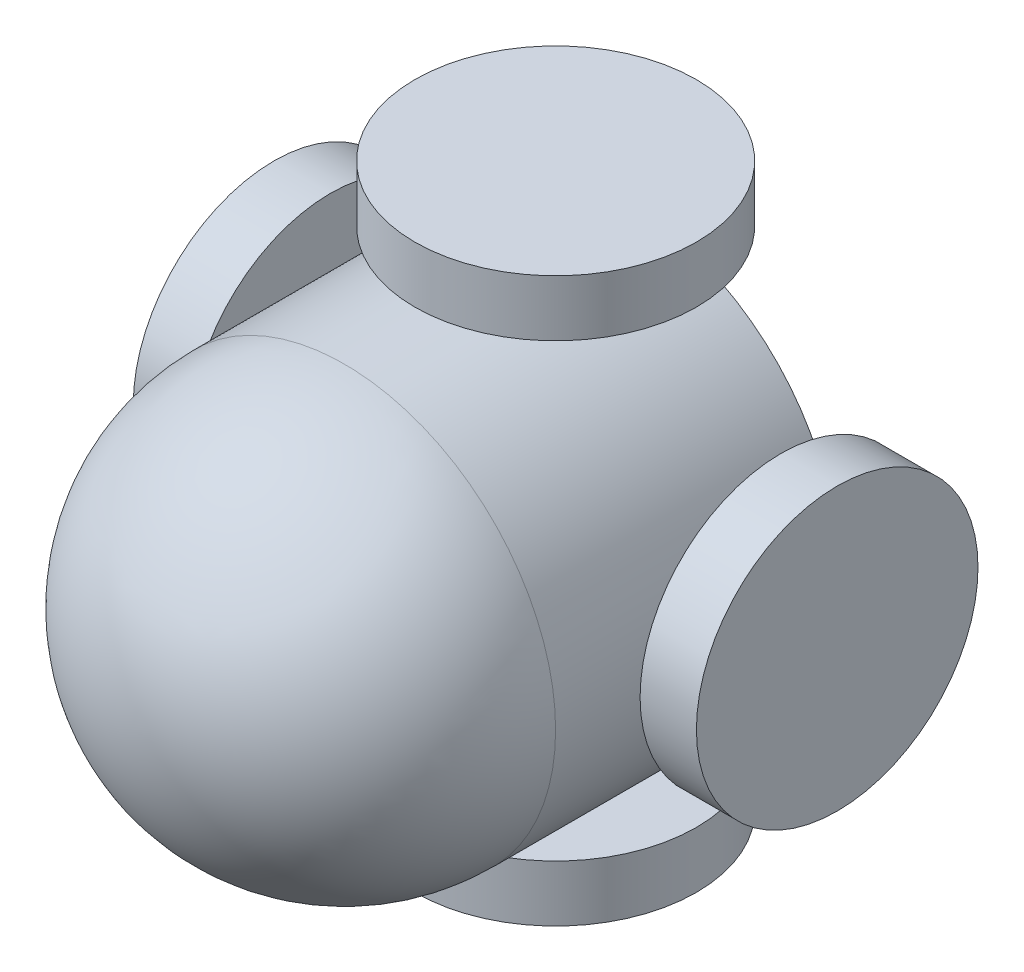
ISO-10303-21;
HEADER;
FILE_DESCRIPTION(('STEP AP214'),'2;1');
FILE_NAME('part.step','',(''),(''),'','','');
FILE_SCHEMA(('AUTOMOTIVE_DESIGN { 1 0 10303 214 1 1 1 1 }'));
ENDSEC;
DATA;
#1=APPLICATION_CONTEXT('core data for automotive mechanical design processes');
#2=APPLICATION_PROTOCOL_DEFINITION('international standard','automotive_design',2000,#1);
#3=PRODUCT_CONTEXT('',#1,'mechanical');
#4=PRODUCT('Part','Part','',(#3));
#5=PRODUCT_RELATED_PRODUCT_CATEGORY('part','',(#4));
#6=PRODUCT_DEFINITION_FORMATION('','',#4);
#7=PRODUCT_DEFINITION_CONTEXT('part definition',#1,'design');
#8=PRODUCT_DEFINITION('design','',#6,#7);
#9=PRODUCT_DEFINITION_SHAPE('','',#8);
#10=(LENGTH_UNIT() NAMED_UNIT(*) SI_UNIT(.MILLI.,.METRE.));
#11=(NAMED_UNIT(*) PLANE_ANGLE_UNIT() SI_UNIT($,.RADIAN.));
#12=(NAMED_UNIT(*) SI_UNIT($,.STERADIAN.) SOLID_ANGLE_UNIT());
#13=UNCERTAINTY_MEASURE_WITH_UNIT(LENGTH_MEASURE(1.E-05),#10,'distance_accuracy_value','');
#14=(GEOMETRIC_REPRESENTATION_CONTEXT(3) GLOBAL_UNCERTAINTY_ASSIGNED_CONTEXT((#13)) GLOBAL_UNIT_ASSIGNED_CONTEXT((#10,
#11,#12)) REPRESENTATION_CONTEXT('',''));
#15=CARTESIAN_POINT('',(0.,0.,0.));
#16=DIRECTION('',(0.,0.,1.));
#17=DIRECTION('',(1.,0.,0.));
#18=AXIS2_PLACEMENT_3D('',#15,#16,#17);
#19=CARTESIAN_POINT('',(0.,2.,1.));
#20=DIRECTION('',(0.,-1.,0.));
#21=DIRECTION('',(1.,0.,0.));
#22=AXIS2_PLACEMENT_3D('',#19,#20,#21);
#23=CYLINDRICAL_SURFACE('',#22,0.25);
#24=CARTESIAN_POINT('',(0.250000000000005,-1.4790199457749,1.));
#25=CARTESIAN_POINT('',(0.249999439842106,-1.47902019740128,1.0139375748146));
#26=CARTESIAN_POINT('',(0.248830516903737,-1.47921909254807,1.02788276060249));
#27=CARTESIAN_POINT('',(0.244187742807545,-1.47999245736818,1.05538185432202));
#28=CARTESIAN_POINT('',(0.240711766030971,-1.48056727339143,1.06893538937495));
#29=CARTESIAN_POINT('',(0.231562954366719,-1.48202560932232,1.09524922833568));
#30=CARTESIAN_POINT('',(0.225891955493114,-1.48290887117195,1.10801018486663));
#31=CARTESIAN_POINT('',(0.212518649689042,-1.48488427211434,1.13239809547137));
#32=CARTESIAN_POINT('',(0.204816571350162,-1.48597638769747,1.14402517695762));
#33=CARTESIAN_POINT('',(0.187518752696635,-1.48825847115261,1.16593128497457));
#34=CARTESIAN_POINT('',(0.177906904893233,-1.48944921732707,1.17619751313865));
#35=CARTESIAN_POINT('',(0.157097200469539,-1.49178748066946,1.19497933068615));
#36=CARTESIAN_POINT('',(0.145899249915004,-1.49293499527197,1.20349481631153));
#37=CARTESIAN_POINT('',(0.122152286994839,-1.49506573698247,1.21858145672194));
#38=CARTESIAN_POINT('',(0.109595608145676,-1.49604794243228,1.22514070077318));
#39=CARTESIAN_POINT('',(0.0835395621723927,-1.49772873695715,1.23605210705305));
#40=CARTESIAN_POINT('',(0.0700402564078244,-1.49842734447267,1.24040441278849));
#41=CARTESIAN_POINT('',(0.0426143726344296,-1.49945673472438,1.24673925349839));
#42=CARTESIAN_POINT('',(0.0286928886679326,-1.4997908531109,1.24874329160047));
#43=CARTESIAN_POINT('',(0.000707528552585234,-1.50006507934278,1.25039157541526));
#44=CARTESIAN_POINT('',(-0.0133563378528844,-1.50000521396931,1.25003598152472));
#45=CARTESIAN_POINT('',(-0.0410802185078822,-1.49950085843139,1.24699186484718));
#46=CARTESIAN_POINT('',(-0.0547428530700087,-1.4990601836924,1.24432648365909));
#47=CARTESIAN_POINT('',(-0.0814241979611737,-1.49784797877164,1.23677489257535));
#48=CARTESIAN_POINT('',(-0.094442888665145,-1.49707643851321,1.23188861504105));
#49=CARTESIAN_POINT('',(-0.119535614778259,-1.49528269851196,1.22001093596847));
#50=CARTESIAN_POINT('',(-0.131605052301899,-1.49425936732688,1.21300999879176));
#51=CARTESIAN_POINT('',(-0.154406552984659,-1.4920757380715,1.1971087177365));
#52=CARTESIAN_POINT('',(-0.165138507791582,-1.49091542891914,1.18820822012892));
#53=CARTESIAN_POINT('',(-0.185097127344661,-1.4885702682326,1.16863211933807));
#54=CARTESIAN_POINT('',(-0.194303950225315,-1.48738528973104,1.1579362905099));
#55=CARTESIAN_POINT('',(-0.210795458844801,-1.48513795978481,1.13514129097842));
#56=CARTESIAN_POINT('',(-0.218080126853236,-1.48407560947133,1.12304210733172));
#57=CARTESIAN_POINT('',(-0.230524443448823,-1.48219375456182,1.09776083581225));
#58=CARTESIAN_POINT('',(-0.235681702727919,-1.4813745233026,1.08457755019079));
#59=CARTESIAN_POINT('',(-0.243702987081557,-1.48007618868988,1.05751509276925));
#60=CARTESIAN_POINT('',(-0.24656721407679,-1.47959705538832,1.04363598235676));
#61=CARTESIAN_POINT('',(-0.249893188487921,-1.47903895942212,1.01575338438379));
#62=CARTESIAN_POINT('',(-0.250383220791239,-1.47895528575867,1.00175336202979));
#63=CARTESIAN_POINT('',(-0.249022270268241,-1.47918503478236,0.973871332830918));
#64=CARTESIAN_POINT('',(-0.247171377862461,-1.47949844213185,0.959989321448603));
#65=CARTESIAN_POINT('',(-0.241205233492805,-1.48048268745502,0.932827224080914));
#66=CARTESIAN_POINT('',(-0.237104379064633,-1.48115125191835,0.919543886012199));
#67=CARTESIAN_POINT('',(-0.226769819019222,-1.4827685730055,0.893852983372052));
#68=CARTESIAN_POINT('',(-0.220535985810088,-1.48371734639058,0.88144547124491));
#69=CARTESIAN_POINT('',(-0.206045667322918,-1.48579912839739,0.857732540559389));
#70=CARTESIAN_POINT('',(-0.197771056415931,-1.48693375560035,0.846438342724394));
#71=CARTESIAN_POINT('',(-0.179458946570793,-1.48925466667987,0.8253886467305));
#72=CARTESIAN_POINT('',(-0.169421323638399,-1.49044095418533,0.815633256889026));
#73=CARTESIAN_POINT('',(-0.147742807032876,-1.49274642211826,0.79783481072713));
#74=CARTESIAN_POINT('',(-0.136086325338614,-1.49386477634467,0.789810617371546));
#75=CARTESIAN_POINT('',(-0.111574344794927,-1.49589511243294,0.775834467299512));
#76=CARTESIAN_POINT('',(-0.0987188847470574,-1.49680710096998,0.769882443552615));
#77=CARTESIAN_POINT('',(-0.0722299051501275,-1.49831835816958,0.760248941604514));
#78=CARTESIAN_POINT('',(-0.0586000562602558,-1.49891898456762,0.756557592426508));
#79=CARTESIAN_POINT('',(-0.030903073487416,-1.49974558316928,0.751518440103617));
#80=CARTESIAN_POINT('',(-0.0168359756821572,-1.49997158620018,0.750170444126764));
#81=CARTESIAN_POINT('',(0.0111541275773733,-1.50002303788783,0.749861811768781));
#82=CARTESIAN_POINT('',(0.0250768160602731,-1.49985330202424,0.750872474605894));
#83=CARTESIAN_POINT('',(0.0525511974314742,-1.49914217838728,0.75519039222694));
#84=CARTESIAN_POINT('',(0.0661028923967477,-1.498600792695,0.758497634150956));
#85=CARTESIAN_POINT('',(0.0924396445918645,-1.49720698882758,0.767303816554376));
#86=CARTESIAN_POINT('',(0.105225537215408,-1.49635491704155,0.772800316821045));
#87=CARTESIAN_POINT('',(0.129698045298202,-1.49443275687735,0.785825793623018));
#88=CARTESIAN_POINT('',(0.141384608611752,-1.49336265816488,0.793354866506097));
#89=CARTESIAN_POINT('',(0.163471294552721,-1.49110762961897,0.8103335092462));
#90=CARTESIAN_POINT('',(0.173855143060567,-1.48992152455073,0.819804095475687));
#91=CARTESIAN_POINT('',(0.19289638759481,-1.48757630330475,0.840352830789819));
#92=CARTESIAN_POINT('',(0.201553378670124,-1.4864171935136,0.851431355889154));
#93=CARTESIAN_POINT('',(0.216951427091967,-1.4842483435701,0.874974532250764));
#94=CARTESIAN_POINT('',(0.223678498909459,-1.48323971798123,0.887448433983805));
#95=CARTESIAN_POINT('',(0.234931453644096,-1.48149921022177,0.913360923591143));
#96=CARTESIAN_POINT('',(0.239459535523165,-1.48076705175127,0.926798532269689));
#97=CARTESIAN_POINT('',(0.24520260531222,-1.47982474483778,0.950240376947666));
#98=CARTESIAN_POINT('',(0.246998741767033,-1.47952462342102,0.960102680795843));
#99=CARTESIAN_POINT('',(0.249397629518247,-1.47912213528652,0.979975348484111));
#100=CARTESIAN_POINT('',(0.250000402479198,-1.47901976497878,0.989985709633016));
#101=CARTESIAN_POINT('',(0.250000000000005,-1.4790199457749,1.));
#102=B_SPLINE_CURVE_WITH_KNOTS('',3,(#24,#25,#26,#27,#28,#29,#30,#31,#32,#33,#34,#35,#36,#37,
#38,#39,#40,#41,#42,#43,#44,#45,#46,#47,#48,#49,#50,#51,#52,#53,#54,#55,#56,#57,#58,#59,#60,#61,
#62,#63,#64,#65,#66,#67,#68,#69,#70,#71,#72,#73,#74,#75,#76,#77,#78,#79,#80,#81,#82,#83,#84,#85,
#86,#87,#88,#89,#90,#91,#92,#93,#94,#95,#96,#97,#98,#99,#100,#101),.UNSPECIFIED.,.T.,.F.,(4,2,2,
2,2,2,2,2,2,2,2,2,2,2,2,2,2,2,2,2,2,2,2,2,2,2,2,2,2,2,2,2,2,2,2,2,2,2,4),(0.,0.0417761038905316,
0.0835907519919449,0.125370499783167,0.167145547400922,0.209289159151362,0.251435267830095,
0.293832980107083,0.336227935106761,0.378231567468213,0.42023234464834,0.461817121160316,
0.503403164245181,0.545179604135073,0.586959426222412,0.629246123457771,0.671533210741667,
0.713867662494251,0.756198385933725,0.798023542416058,0.839847083409624,0.88140606463114,
0.922967532289222,0.96491234275835,1.00686010442634,1.04924411303103,1.09162675047235,
1.13382298441329,1.176015745908,1.21769777626156,1.25937957321447,1.30101503982811,
1.34265248038798,1.3847669974589,1.42689137887746,1.46931372761285,1.51169356673763,
1.54171067053694,1.57172722939499),.UNSPECIFIED.);
#103=CARTESIAN_POINT('',(0.250000000000005,-1.4790199457749,1.));
#104=VERTEX_POINT('',#103);
#105=EDGE_CURVE('E82',#104,#104,#102,.T.);
#106=ORIENTED_EDGE('',*,*,#105,.T.);
#107=EDGE_LOOP('',(#106));
#108=FACE_BOUND('',#107,.T.);
#109=CARTESIAN_POINT('',(0.,-1.6,1.));
#110=DIRECTION('',(0.,-1.,0.));
#111=DIRECTION('',(1.,0.,0.));
#112=AXIS2_PLACEMENT_3D('',#109,#110,#111);
#113=CIRCLE('',#112,0.25);
#114=CARTESIAN_POINT('',(0.250000000000006,-1.6,1.));
#115=VERTEX_POINT('',#114);
#116=EDGE_CURVE('E10',#115,#115,#113,.T.);
#117=ORIENTED_EDGE('',*,*,#116,.F.);
#118=EDGE_LOOP('',(#117));
#119=FACE_BOUND('',#118,.T.);
#120=ADVANCED_FACE('F30',(#108,#119),#23,.T.);
#121=CARTESIAN_POINT('',(-2.,0.,1.));
#122=DIRECTION('',(1.,0.,0.));
#123=DIRECTION('',(0.,0.,-1.));
#124=AXIS2_PLACEMENT_3D('',#121,#122,#123);
#125=CYLINDRICAL_SURFACE('',#124,0.25);
#126=CARTESIAN_POINT('',(-1.5,0.,1.25));
#127=CARTESIAN_POINT('',(-1.49999976116882,0.0139390904958215,1.24999944110522));
#128=CARTESIAN_POINT('',(-1.49980367791303,0.0278857881838821,1.24883027250311));
#129=CARTESIAN_POINT('',(-1.49904034494139,0.0553880221673043,1.24418643412347));
#130=CARTESIAN_POINT('',(-1.49847275392389,0.0689431867959247,1.24070964430884));
#131=CARTESIAN_POINT('',(-1.49703006823645,0.0952604747212644,1.23155845514072));
#132=CARTESIAN_POINT('',(-1.49615522515919,0.10802323684319,1.22588585343594));
#133=CARTESIAN_POINT('',(-1.49419422708207,0.132414184197795,1.21250877079476));
#134=CARTESIAN_POINT('',(-1.49310809625443,0.144042498987859,1.2048045222517));
#135=CARTESIAN_POINT('',(-1.49083331745831,0.165947261429168,1.18750449161795));
#136=CARTESIAN_POINT('',(-1.48964387181486,0.176211290353497,1.17789308853639));
#137=CARTESIAN_POINT('',(-1.48730262687673,0.194988849865993,1.15708520315272));
#138=CARTESIAN_POINT('',(-1.48615082996267,0.203502269939097,1.14588862085434));
#139=CARTESIAN_POINT('',(-1.48400756575978,0.218586712560513,1.12214290338029));
#140=CARTESIAN_POINT('',(-1.48301712909164,0.2251454552861,1.10958586631952));
#141=CARTESIAN_POINT('',(-1.48131978979468,0.236055836541122,1.08352904356994));
#142=CARTESIAN_POINT('',(-1.48061286801431,0.240407624156561,1.07002932163224));
#143=CARTESIAN_POINT('',(-1.47957053684276,0.246741437778481,1.04260197251435));
#144=CARTESIAN_POINT('',(-1.4792317684857,0.24874490291354,1.02867942634986));
#145=CARTESIAN_POINT('',(-1.47895393893665,0.250391672528988,1.00069197231165));
#146=CARTESIAN_POINT('',(-1.47901484945721,0.2500351440389,0.98662707458327));
#147=CARTESIAN_POINT('',(-1.47952642886356,0.246989509839615,0.958907213872455));
#148=CARTESIAN_POINT('',(-1.47997307331892,0.244324488188978,0.945249519645477));
#149=CARTESIAN_POINT('',(-1.48119949521101,0.236775314040345,0.918577868217087));
#150=CARTESIAN_POINT('',(-1.48197928407327,0.231891085431974,0.905563933111145));
#151=CARTESIAN_POINT('',(-1.4837884793341,0.220017724609391,0.880477117655908));
#152=CARTESIAN_POINT('',(-1.48481906710733,0.213018591387972,0.868409059391877));
#153=CARTESIAN_POINT('',(-1.48701291841501,0.197121201755744,0.845609559946162));
#154=CARTESIAN_POINT('',(-1.48817619265429,0.188222792065429,0.834878226754507));
#155=CARTESIAN_POINT('',(-1.49052202787979,0.168648221215906,0.814917391419265));
#156=CARTESIAN_POINT('',(-1.49170464923165,0.157951396387313,0.805708148145992));
#157=CARTESIAN_POINT('',(-1.49394260139672,0.135153524898165,0.789212223733466));
#158=CARTESIAN_POINT('',(-1.49499793138975,0.123052469190642,0.781925554981677));
#159=CARTESIAN_POINT('',(-1.49686389289291,0.0977705916166714,0.769479777286372));
#160=CARTESIAN_POINT('',(-1.49767431840745,0.0845888725564664,0.764322458066874));
#161=CARTESIAN_POINT('',(-1.49895750301266,0.0575298345602734,0.756300578475402));
#162=CARTESIAN_POINT('',(-1.49943029035047,0.0436525739179471,0.753435826302628));
#163=CARTESIAN_POINT('',(-1.49998112984269,0.0157709901301626,0.750107864153887));
#164=CARTESIAN_POINT('',(-1.50006375301278,0.00177007371510134,0.749616842819439));
#165=CARTESIAN_POINT('',(-1.49983747442117,-0.0261139772889885,0.750976134442812));
#166=CARTESIAN_POINT('',(-1.49952858772412,-0.0399971163892036,0.752826357313374));
#167=CARTESIAN_POINT('',(-1.4985568269382,-0.0671656175546761,0.758792484933548));
#168=CARTESIAN_POINT('',(-1.49789610480131,-0.0804540868385377,0.762894620839012));
#169=CARTESIAN_POINT('',(-1.49629446445536,-0.106154688486044,0.773233451819953));
#170=CARTESIAN_POINT('',(-1.49535353051202,-0.118566771590972,0.779470266763527));
#171=CARTESIAN_POINT('',(-1.49328451630241,-0.142283068946896,0.793965112469679));
#172=CARTESIAN_POINT('',(-1.49215485588702,-0.153576525093715,0.802240515616725));
#173=CARTESIAN_POINT('',(-1.4898384673919,-0.174624358550269,0.820553731538506));
#174=CARTESIAN_POINT('',(-1.48865173517155,-0.184378623969658,0.830591672327667));
#175=CARTESIAN_POINT('',(-1.48634017523585,-0.2021742779658,0.852269754807142));
#176=CARTESIAN_POINT('',(-1.48521611613711,-0.210196876111371,0.863925416551441));
#177=CARTESIAN_POINT('',(-1.48317152977788,-0.224170231029498,0.888435296913854));
#178=CARTESIAN_POINT('',(-1.48225099606602,-0.230121053476982,0.901289477522749));
#179=CARTESIAN_POINT('',(-1.4807234536977,-0.239753833147315,0.927778973281213));
#180=CARTESIAN_POINT('',(-1.48011515431106,-0.243445143254794,0.941410809503049));
#181=CARTESIAN_POINT('',(-1.47927771683526,-0.248483545377828,0.969112012922176));
#182=CARTESIAN_POINT('',(-1.47904854578272,-0.249830841194617,0.983181341973205));
#183=CARTESIAN_POINT('',(-1.47899673308401,-0.250137286604735,1.01117051659624));
#184=CARTESIAN_POINT('',(-1.47916905650565,-0.249126013612519,1.02509003785753));
#185=CARTESIAN_POINT('',(-1.47988978145373,-0.244807983895685,1.05255792480508));
#186=CARTESIAN_POINT('',(-1.48043818176121,-0.241501234611248,1.06610629169419));
#187=CARTESIAN_POINT('',(-1.48184735628172,-0.23269744895949,1.09243584372926));
#188=CARTESIAN_POINT('',(-1.48270776721967,-0.227202959060044,1.1052179010056));
#189=CARTESIAN_POINT('',(-1.48464436892221,-0.214182700391591,1.12968356691948));
#190=CARTESIAN_POINT('',(-1.4857205703884,-0.206656830874856,1.14136712103721));
#191=CARTESIAN_POINT('',(-1.48798345404562,-0.189681888437216,1.16345355831078));
#192=CARTESIAN_POINT('',(-1.4891712955763,-0.180211056359365,1.17383960167003));
#193=CARTESIAN_POINT('',(-1.49151437236084,-0.159660903138023,1.19288516044749));
#194=CARTESIAN_POINT('',(-1.49266960002655,-0.148581211291264,1.20154427686382));
#195=CARTESIAN_POINT('',(-1.49482652964222,-0.125036916964028,1.21694482681999));
#196=CARTESIAN_POINT('',(-1.4958271162531,-0.112563278753282,1.2236726039313));
#197=CARTESIAN_POINT('',(-1.49755116760178,-0.0866513069378981,1.23492694846099));
#198=CARTESIAN_POINT('',(-1.49827490817748,-0.0732139494830009,1.23945570810797));
#199=CARTESIAN_POINT('',(-1.49920579083296,-0.04977033100454,1.24520052741267));
#200=CARTESIAN_POINT('',(-1.49950202727336,-0.0399058830298447,1.2469974469616));
#201=CARTESIAN_POINT('',(-1.49989921598612,-0.0200289310319809,1.24939737378448));
#202=CARTESIAN_POINT('',(-1.50000017162064,-0.0100164295608494,1.25000040161374));
#203=CARTESIAN_POINT('',(-1.5,0.,1.25));
#204=B_SPLINE_CURVE_WITH_KNOTS('',3,(#126,#127,#128,#129,#130,#131,#132,#133,#134,#135,#136,
#137,#138,#139,#140,#141,#142,#143,#144,#145,#146,#147,#148,#149,#150,#151,#152,#153,#154,#155,
#156,#157,#158,#159,#160,#161,#162,#163,#164,#165,#166,#167,#168,#169,#170,#171,#172,#173,#174,
#175,#176,#177,#178,#179,#180,#181,#182,#183,#184,#185,#186,#187,#188,#189,#190,#191,#192,#193,
#194,#195,#196,#197,#198,#199,#200,#201,#202,#203),.UNSPECIFIED.,.T.,.F.,(4,2,2,2,2,2,2,2,2,2,2,
2,2,2,2,2,2,2,2,2,2,2,2,2,2,2,2,2,2,2,2,2,2,2,2,2,2,2,4),(0.,0.0417806584938509,
0.083599754569542,0.125384686702527,0.167164841267479,0.209302491062332,0.251442800169857,
0.29384252082384,0.336239376876181,0.378246077103424,0.420249804320886,0.461820521760409,
0.503392665025381,0.545164556632558,0.586939820680574,0.629232769911327,0.671525991635848,
0.713854688915903,0.756179844521149,0.798007883491397,0.83983431303586,0.881407807006416,
0.922983635826067,0.964926825627024,1.00687306305428,1.04925382200762,1.09163323737594,
1.13383602234177,1.17603513778662,1.2177079095227,1.25938054618813,1.30100481822622,
1.34263115502934,1.38475138419339,1.42688133387897,1.4693022316072,1.51168075213007,
1.54170424816402,1.57172722727697),.UNSPECIFIED.);
#205=CARTESIAN_POINT('',(-1.5,0.,1.25));
#206=VERTEX_POINT('',#205);
#207=EDGE_CURVE('E46',#206,#206,#204,.T.);
#208=ORIENTED_EDGE('',*,*,#207,.T.);
#209=EDGE_LOOP('',(#208));
#210=FACE_BOUND('',#209,.T.);
#211=CARTESIAN_POINT('',(-1.6,0.,1.));
#212=DIRECTION('',(-1.,0.,0.));
#213=DIRECTION('',(0.,0.,1.));
#214=AXIS2_PLACEMENT_3D('',#211,#212,#213);
#215=CIRCLE('',#214,0.25);
#216=CARTESIAN_POINT('',(-1.6,0.,1.25));
#217=VERTEX_POINT('',#216);
#218=EDGE_CURVE('E38',#217,#217,#215,.T.);
#219=ORIENTED_EDGE('',*,*,#218,.F.);
#220=EDGE_LOOP('',(#219));
#221=FACE_BOUND('',#220,.T.);
#222=ADVANCED_FACE('F61',(#210,#221),#125,.T.);
#223=CARTESIAN_POINT('',(0.249999999999995,1.47901994577491,1.));
#224=CARTESIAN_POINT('',(0.249999439842096,1.47902019740128,0.986062425185397));
#225=CARTESIAN_POINT('',(0.248830516903727,1.47921909254807,0.972117239397513));
#226=CARTESIAN_POINT('',(0.244187742807534,1.47999245736818,0.944618145677984));
#227=CARTESIAN_POINT('',(0.24071176603096,1.48056727339143,0.931064610625048));
#228=CARTESIAN_POINT('',(0.231562954366709,1.48202560932233,0.904750771664322));
#229=CARTESIAN_POINT('',(0.225891955493104,1.48290887117195,0.891989815133369));
#230=CARTESIAN_POINT('',(0.212518649689032,1.48488427211434,0.867601904528629));
#231=CARTESIAN_POINT('',(0.204816571350152,1.48597638769747,0.855974823042376));
#232=CARTESIAN_POINT('',(0.187518752696625,1.48825847115261,0.834068715025433));
#233=CARTESIAN_POINT('',(0.177906904893222,1.48944921732707,0.823802486861349));
#234=CARTESIAN_POINT('',(0.157097200469529,1.49178748066946,0.805020669313849));
#235=CARTESIAN_POINT('',(0.145899249914994,1.49293499527197,0.796505183688466));
#236=CARTESIAN_POINT('',(0.122152286994829,1.49506573698247,0.781418543278064));
#237=CARTESIAN_POINT('',(0.109595608145665,1.49604794243228,0.774859299226817));
#238=CARTESIAN_POINT('',(0.0835395621723821,1.49772873695716,0.763947892946947));
#239=CARTESIAN_POINT('',(0.0700402564078138,1.49842734447268,0.759595587211513));
#240=CARTESIAN_POINT('',(0.042614372634419,1.49945673472438,0.753260746501609));
#241=CARTESIAN_POINT('',(0.0286928886679219,1.4997908531109,0.751256708399531));
#242=CARTESIAN_POINT('',(0.000707528552574572,1.50006507934278,0.74960842458474));
#243=CARTESIAN_POINT('',(-0.013356337852895,1.50000521396931,0.749964018475277));
#244=CARTESIAN_POINT('',(-0.0410802185078928,1.49950085843139,0.753008135152821));
#245=CARTESIAN_POINT('',(-0.0547428530700193,1.4990601836924,0.755673516340915));
#246=CARTESIAN_POINT('',(-0.0814241979611843,1.49784797877164,0.763225107424649));
#247=CARTESIAN_POINT('',(-0.0944428886651556,1.49707643851321,0.76811138495895));
#248=CARTESIAN_POINT('',(-0.11953561477827,1.49528269851196,0.779989064031532));
#249=CARTESIAN_POINT('',(-0.13160505230191,1.49425936732688,0.786990001208244));
#250=CARTESIAN_POINT('',(-0.154406552984669,1.4920757380715,0.802891282263505));
#251=CARTESIAN_POINT('',(-0.165138507791593,1.49091542891913,0.811791779871082));
#252=CARTESIAN_POINT('',(-0.185097127344672,1.4885702682326,0.831367880661931));
#253=CARTESIAN_POINT('',(-0.194303950225326,1.48738528973104,0.842063709490098));
#254=CARTESIAN_POINT('',(-0.210795458844812,1.48513795978481,0.864858709021582));
#255=CARTESIAN_POINT('',(-0.218080126853247,1.48407560947132,0.876957892668282));
#256=CARTESIAN_POINT('',(-0.230524443448834,1.48219375456182,0.902239164187748));
#257=CARTESIAN_POINT('',(-0.235681702727929,1.4813745233026,0.915422449809209));
#258=CARTESIAN_POINT('',(-0.243702987081567,1.48007618868988,0.942484907230755));
#259=CARTESIAN_POINT('',(-0.246567214076801,1.47959705538832,0.956364017643242));
#260=CARTESIAN_POINT('',(-0.249893188487932,1.47903895942212,0.984246615616213));
#261=CARTESIAN_POINT('',(-0.250383220791249,1.47895528575867,0.99824663797021));
#262=CARTESIAN_POINT('',(-0.249022270268251,1.47918503478236,1.02612866716908));
#263=CARTESIAN_POINT('',(-0.247171377862472,1.47949844213185,1.0400106785514));
#264=CARTESIAN_POINT('',(-0.241205233492815,1.48048268745502,1.06717277591909));
#265=CARTESIAN_POINT('',(-0.237104379064644,1.48115125191835,1.0804561139878));
#266=CARTESIAN_POINT('',(-0.226769819019233,1.4827685730055,1.10614701662795));
#267=CARTESIAN_POINT('',(-0.220535985810099,1.48371734639058,1.11855452875509));
#268=CARTESIAN_POINT('',(-0.206045667322928,1.48579912839739,1.14226745944061));
#269=CARTESIAN_POINT('',(-0.197771056415941,1.48693375560035,1.15356165727561));
#270=CARTESIAN_POINT('',(-0.179458946570803,1.48925466667987,1.1746113532695));
#271=CARTESIAN_POINT('',(-0.16942132363841,1.49044095418533,1.18436674311097));
#272=CARTESIAN_POINT('',(-0.147742807032886,1.49274642211826,1.20216518927287));
#273=CARTESIAN_POINT('',(-0.136086325338625,1.49386477634467,1.21018938262845));
#274=CARTESIAN_POINT('',(-0.111574344794938,1.49589511243294,1.22416553270049));
#275=CARTESIAN_POINT('',(-0.0987188847470677,1.49680710096998,1.23011755644739));
#276=CARTESIAN_POINT('',(-0.0722299051501379,1.49831835816958,1.23975105839549));
#277=CARTESIAN_POINT('',(-0.0586000562602661,1.49891898456762,1.24344240757349));
#278=CARTESIAN_POINT('',(-0.0309030734874263,1.49974558316928,1.24848155989638));
#279=CARTESIAN_POINT('',(-0.0168359756821675,1.49997158620018,1.24982955587324));
#280=CARTESIAN_POINT('',(0.011154127577363,1.50002303788783,1.25013818823122));
#281=CARTESIAN_POINT('',(0.0250768160602629,1.49985330202424,1.24912752539411));
#282=CARTESIAN_POINT('',(0.052551197431464,1.49914217838728,1.24480960777306));
#283=CARTESIAN_POINT('',(0.0661028923967374,1.498600792695,1.24150236584904));
#284=CARTESIAN_POINT('',(0.0924396445918541,1.49720698882759,1.23269618344562));
#285=CARTESIAN_POINT('',(0.105225537215397,1.49635491704156,1.22719968317896));
#286=CARTESIAN_POINT('',(0.129698045298192,1.49443275687735,1.21417420637698));
#287=CARTESIAN_POINT('',(0.141384608611741,1.49336265816488,1.2066451334939));
#288=CARTESIAN_POINT('',(0.163471294552711,1.49110762961897,1.1896664907538));
#289=CARTESIAN_POINT('',(0.173855143060556,1.48992152455073,1.18019590452431));
#290=CARTESIAN_POINT('',(0.192896387594799,1.48757630330475,1.15964716921018));
#291=CARTESIAN_POINT('',(0.201553378670114,1.4864171935136,1.14856864411085));
#292=CARTESIAN_POINT('',(0.216951427091956,1.4842483435701,1.12502546774924));
#293=CARTESIAN_POINT('',(0.223678498909449,1.48323971798124,1.1125515660162));
#294=CARTESIAN_POINT('',(0.234931453644086,1.48149921022177,1.08663907640886));
#295=CARTESIAN_POINT('',(0.239459535523155,1.48076705175127,1.07320146773031));
#296=CARTESIAN_POINT('',(0.245202605312209,1.47982474483778,1.04975962305233));
#297=CARTESIAN_POINT('',(0.246998741767023,1.47952462342102,1.03989731920416));
#298=CARTESIAN_POINT('',(0.249397629518237,1.47912213528652,1.02002465151589));
#299=CARTESIAN_POINT('',(0.250000402479188,1.47901976497878,1.01001429036698));
#300=CARTESIAN_POINT('',(0.249999999999995,1.47901994577491,1.));
#301=B_SPLINE_CURVE_WITH_KNOTS('',3,(#223,#224,#225,#226,#227,#228,#229,#230,#231,#232,#233,
#234,#235,#236,#237,#238,#239,#240,#241,#242,#243,#244,#245,#246,#247,#248,#249,#250,#251,#252,
#253,#254,#255,#256,#257,#258,#259,#260,#261,#262,#263,#264,#265,#266,#267,#268,#269,#270,#271,
#272,#273,#274,#275,#276,#277,#278,#279,#280,#281,#282,#283,#284,#285,#286,#287,#288,#289,#290,
#291,#292,#293,#294,#295,#296,#297,#298,#299,#300),.UNSPECIFIED.,.T.,.F.,(4,2,2,2,2,2,2,2,2,2,2,
2,2,2,2,2,2,2,2,2,2,2,2,2,2,2,2,2,2,2,2,2,2,2,2,2,2,2,4),(0.,0.0417761038905319,
0.0835907519919449,0.125370499783167,0.167145547400922,0.209289159151363,0.251435267830095,
0.293832980107083,0.336227935106761,0.378231567468213,0.42023234464834,0.461817121160316,
0.503403164245181,0.545179604135073,0.586959426222412,0.629246123457772,0.671533210741667,
0.713867662494252,0.756198385933725,0.798023542416058,0.839847083409624,0.88140606463114,
0.922967532289223,0.96491234275835,1.00686010442634,1.04924411303103,1.09162675047235,
1.13382298441329,1.176015745908,1.21769777626157,1.25937957321447,1.30101503982811,
1.34265248038798,1.3847669974589,1.42689137887746,1.46931372761285,1.51169356673763,
1.54171067053694,1.57172722939499),.UNSPECIFIED.);
#302=CARTESIAN_POINT('',(0.249999999999995,1.47901994577491,1.));
#303=VERTEX_POINT('',#302);
#304=EDGE_CURVE('E55',#303,#303,#301,.T.);
#305=ORIENTED_EDGE('',*,*,#304,.T.);
#306=EDGE_LOOP('',(#305));
#307=FACE_BOUND('',#306,.T.);
#308=CARTESIAN_POINT('',(0.,1.6,1.));
#309=DIRECTION('',(0.,1.,0.));
#310=DIRECTION('',(-1.,0.,0.));
#311=AXIS2_PLACEMENT_3D('',#308,#309,#310);
#312=CIRCLE('',#311,0.25);
#313=CARTESIAN_POINT('',(-0.250000000000006,1.6,1.));
#314=VERTEX_POINT('',#313);
#315=EDGE_CURVE('E42',#314,#314,#312,.T.);
#316=ORIENTED_EDGE('',*,*,#315,.F.);
#317=EDGE_LOOP('',(#316));
#318=FACE_BOUND('',#317,.T.);
#319=ADVANCED_FACE('F66',(#307,#318),#23,.T.);
#320=CARTESIAN_POINT('',(0.,0.,2.5));
#321=DIRECTION('',(0.,0.,-1.));
#322=DIRECTION('',(-1.,0.,0.));
#323=AXIS2_PLACEMENT_3D('',#320,#321,#322);
#324=CYLINDRICAL_SURFACE('',#323,1.5);
#325=CARTESIAN_POINT('',(0.,0.,2.5));
#326=DIRECTION('',(0.,0.,1.));
#327=DIRECTION('',(1.,0.,0.));
#328=AXIS2_PLACEMENT_3D('',#325,#326,#327);
#329=CIRCLE('',#328,1.5);
#330=CARTESIAN_POINT('',(1.5,0.,2.5));
#331=VERTEX_POINT('',#330);
#332=EDGE_CURVE('E98',#331,#331,#329,.T.);
#333=ORIENTED_EDGE('',*,*,#332,.F.);
#334=EDGE_LOOP('',(#333));
#335=FACE_BOUND('',#334,.T.);
#336=CARTESIAN_POINT('',(0.,0.,0.5));
#337=DIRECTION('',(0.,0.,1.));
#338=DIRECTION('',(1.,0.,0.));
#339=AXIS2_PLACEMENT_3D('',#336,#337,#338);
#340=CIRCLE('',#339,1.5);
#341=CARTESIAN_POINT('',(1.5,0.,0.5));
#342=VERTEX_POINT('',#341);
#343=EDGE_CURVE('E99',#342,#342,#340,.T.);
#344=ORIENTED_EDGE('',*,*,#343,.T.);
#345=EDGE_LOOP('',(#344));
#346=FACE_BOUND('',#345,.T.);
#347=CARTESIAN_POINT('',(1.5,0.,1.25));
#348=CARTESIAN_POINT('',(1.49999976116882,-0.0139390904958216,1.24999944110522));
#349=CARTESIAN_POINT('',(1.49980367791303,-0.0278857881838822,1.24883027250311));
#350=CARTESIAN_POINT('',(1.49904034494139,-0.0553880221673043,1.24418643412347));
#351=CARTESIAN_POINT('',(1.49847275392389,-0.0689431867959248,1.24070964430884));
#352=CARTESIAN_POINT('',(1.49703006823645,-0.0952604747212644,1.23155845514072));
#353=CARTESIAN_POINT('',(1.49615522515919,-0.10802323684319,1.22588585343594));
#354=CARTESIAN_POINT('',(1.49419422708207,-0.132414184197794,1.21250877079476));
#355=CARTESIAN_POINT('',(1.49310809625443,-0.144042498987859,1.2048045222517));
#356=CARTESIAN_POINT('',(1.49083331745831,-0.165947261429168,1.18750449161795));
#357=CARTESIAN_POINT('',(1.48964387181486,-0.176211290353497,1.17789308853639));
#358=CARTESIAN_POINT('',(1.48730262687673,-0.194988849865993,1.15708520315272));
#359=CARTESIAN_POINT('',(1.48615082996267,-0.203502269939097,1.14588862085434));
#360=CARTESIAN_POINT('',(1.48400756575978,-0.218586712560513,1.12214290338029));
#361=CARTESIAN_POINT('',(1.48301712909164,-0.2251454552861,1.10958586631952));
#362=CARTESIAN_POINT('',(1.48131978979468,-0.236055836541122,1.08352904356994));
#363=CARTESIAN_POINT('',(1.48061286801431,-0.240407624156561,1.07002932163224));
#364=CARTESIAN_POINT('',(1.47957053684276,-0.246741437778481,1.04260197251435));
#365=CARTESIAN_POINT('',(1.4792317684857,-0.24874490291354,1.02867942634986));
#366=CARTESIAN_POINT('',(1.47895393893665,-0.250391672528988,1.00069197231165));
#367=CARTESIAN_POINT('',(1.47901484945721,-0.2500351440389,0.98662707458327));
#368=CARTESIAN_POINT('',(1.47952642886356,-0.246989509839615,0.958907213872455));
#369=CARTESIAN_POINT('',(1.47997307331892,-0.244324488188978,0.945249519645477));
#370=CARTESIAN_POINT('',(1.48119949521101,-0.236775314040345,0.918577868217087));
#371=CARTESIAN_POINT('',(1.48197928407327,-0.231891085431974,0.905563933111146));
#372=CARTESIAN_POINT('',(1.4837884793341,-0.220017724609392,0.880477117655908));
#373=CARTESIAN_POINT('',(1.48481906710733,-0.213018591387972,0.868409059391878));
#374=CARTESIAN_POINT('',(1.48701291841501,-0.197121201755744,0.845609559946162));
#375=CARTESIAN_POINT('',(1.48817619265429,-0.188222792065429,0.834878226754507));
#376=CARTESIAN_POINT('',(1.49052202787979,-0.168648221215906,0.814917391419266));
#377=CARTESIAN_POINT('',(1.49170464923165,-0.157951396387313,0.805708148145992));
#378=CARTESIAN_POINT('',(1.49394260139672,-0.135153524898165,0.789212223733466));
#379=CARTESIAN_POINT('',(1.49499793138975,-0.123052469190643,0.781925554981677));
#380=CARTESIAN_POINT('',(1.49686389289291,-0.0977705916166715,0.769479777286372));
#381=CARTESIAN_POINT('',(1.49767431840745,-0.0845888725564665,0.764322458066874));
#382=CARTESIAN_POINT('',(1.49895750301266,-0.0575298345602735,0.756300578475402));
#383=CARTESIAN_POINT('',(1.49943029035047,-0.0436525739179472,0.753435826302628));
#384=CARTESIAN_POINT('',(1.49998112984269,-0.0157709901301628,0.750107864153887));
#385=CARTESIAN_POINT('',(1.50006375301278,-0.00177007371510151,0.749616842819439));
#386=CARTESIAN_POINT('',(1.49983747442117,0.0261139772889884,0.750976134442812));
#387=CARTESIAN_POINT('',(1.49952858772412,0.0399971163892035,0.752826357313374));
#388=CARTESIAN_POINT('',(1.4985568269382,0.067165617554676,0.758792484933548));
#389=CARTESIAN_POINT('',(1.49789610480131,0.0804540868385376,0.762894620839012));
#390=CARTESIAN_POINT('',(1.49629446445536,0.106154688486044,0.773233451819953));
#391=CARTESIAN_POINT('',(1.49535353051202,0.118566771590972,0.779470266763527));
#392=CARTESIAN_POINT('',(1.49328451630241,0.142283068946896,0.793965112469678));
#393=CARTESIAN_POINT('',(1.49215485588702,0.153576525093715,0.802240515616725));
#394=CARTESIAN_POINT('',(1.4898384673919,0.174624358550269,0.820553731538506));
#395=CARTESIAN_POINT('',(1.48865173517155,0.184378623969658,0.830591672327667));
#396=CARTESIAN_POINT('',(1.48634017523585,0.2021742779658,0.852269754807142));
#397=CARTESIAN_POINT('',(1.48521611613711,0.210196876111371,0.863925416551441));
#398=CARTESIAN_POINT('',(1.48317152977788,0.224170231029498,0.888435296913854));
#399=CARTESIAN_POINT('',(1.48225099606602,0.230121053476982,0.901289477522749));
#400=CARTESIAN_POINT('',(1.4807234536977,0.239753833147315,0.927778973281213));
#401=CARTESIAN_POINT('',(1.48011515431106,0.243445143254794,0.941410809503049));
#402=CARTESIAN_POINT('',(1.47927771683526,0.248483545377828,0.969112012922176));
#403=CARTESIAN_POINT('',(1.47904854578272,0.249830841194617,0.983181341973205));
#404=CARTESIAN_POINT('',(1.47899673308401,0.250137286604735,1.01117051659624));
#405=CARTESIAN_POINT('',(1.47916905650565,0.249126013612519,1.02509003785753));
#406=CARTESIAN_POINT('',(1.47988978145373,0.244807983895685,1.05255792480508));
#407=CARTESIAN_POINT('',(1.48043818176121,0.241501234611248,1.06610629169419));
#408=CARTESIAN_POINT('',(1.48184735628172,0.23269744895949,1.09243584372926));
#409=CARTESIAN_POINT('',(1.48270776721967,0.227202959060044,1.1052179010056));
#410=CARTESIAN_POINT('',(1.48464436892221,0.214182700391591,1.12968356691948));
#411=CARTESIAN_POINT('',(1.4857205703884,0.206656830874856,1.14136712103721));
#412=CARTESIAN_POINT('',(1.48798345404562,0.189681888437216,1.16345355831078));
#413=CARTESIAN_POINT('',(1.4891712955763,0.180211056359365,1.17383960167003));
#414=CARTESIAN_POINT('',(1.49151437236084,0.159660903138023,1.19288516044749));
#415=CARTESIAN_POINT('',(1.49266960002655,0.148581211291264,1.20154427686382));
#416=CARTESIAN_POINT('',(1.49482652964222,0.125036916964028,1.21694482681999));
#417=CARTESIAN_POINT('',(1.4958271162531,0.112563278753282,1.2236726039313));
#418=CARTESIAN_POINT('',(1.49755116760178,0.0866513069378982,1.23492694846099));
#419=CARTESIAN_POINT('',(1.49827490817748,0.073213949483001,1.23945570810797));
#420=CARTESIAN_POINT('',(1.49920579083296,0.0497703310045401,1.24520052741267));
#421=CARTESIAN_POINT('',(1.49950202727336,0.0399058830298448,1.2469974469616));
#422=CARTESIAN_POINT('',(1.49989921598612,0.0200289310319809,1.24939737378448));
#423=CARTESIAN_POINT('',(1.50000017162064,0.0100164295608494,1.25000040161374));
#424=CARTESIAN_POINT('',(1.5,0.,1.25));
#425=B_SPLINE_CURVE_WITH_KNOTS('',3,(#347,#348,#349,#350,#351,#352,#353,#354,#355,#356,#357,
#358,#359,#360,#361,#362,#363,#364,#365,#366,#367,#368,#369,#370,#371,#372,#373,#374,#375,#376,
#377,#378,#379,#380,#381,#382,#383,#384,#385,#386,#387,#388,#389,#390,#391,#392,#393,#394,#395,
#396,#397,#398,#399,#400,#401,#402,#403,#404,#405,#406,#407,#408,#409,#410,#411,#412,#413,#414,
#415,#416,#417,#418,#419,#420,#421,#422,#423,#424),.UNSPECIFIED.,.T.,.F.,(4,2,2,2,2,2,2,2,2,2,2,
2,2,2,2,2,2,2,2,2,2,2,2,2,2,2,2,2,2,2,2,2,2,2,2,2,2,2,4),(0.,0.0417806584938509,
0.083599754569542,0.125384686702527,0.167164841267479,0.209302491062332,0.251442800169857,
0.29384252082384,0.336239376876181,0.378246077103423,0.420249804320886,0.461820521760408,
0.503392665025381,0.545164556632557,0.586939820680573,0.629232769911326,0.671525991635847,
0.713854688915903,0.756179844521149,0.798007883491397,0.83983431303586,0.881407807006415,
0.922983635826066,0.964926825627024,1.00687306305428,1.04925382200762,1.09163323737594,
1.13383602234177,1.17603513778662,1.2177079095227,1.25938054618813,1.30100481822622,
1.34263115502934,1.38475138419339,1.42688133387897,1.4693022316072,1.51168075213007,
1.54170424816402,1.57172722727697),.UNSPECIFIED.);
#426=CARTESIAN_POINT('',(1.5,0.,1.25));
#427=VERTEX_POINT('',#426);
#428=EDGE_CURVE('E91',#427,#427,#425,.T.);
#429=ORIENTED_EDGE('',*,*,#428,.F.);
#430=EDGE_LOOP('',(#429));
#431=FACE_BOUND('',#430,.T.);
#432=ORIENTED_EDGE('',*,*,#105,.F.);
#433=EDGE_LOOP('',(#432));
#434=FACE_BOUND('',#433,.T.);
#435=ORIENTED_EDGE('',*,*,#304,.F.);
#436=EDGE_LOOP('',(#435));
#437=FACE_BOUND('',#436,.T.);
#438=ORIENTED_EDGE('',*,*,#207,.F.);
#439=EDGE_LOOP('',(#438));
#440=FACE_BOUND('',#439,.T.);
#441=ADVANCED_FACE('F32',(#335,#346,#431,#434,#437,#440),#324,.T.);
#442=CARTESIAN_POINT('',(2.,0.,1.));
#443=DIRECTION('',(-1.,0.,0.));
#444=DIRECTION('',(0.,0.,1.));
#445=AXIS2_PLACEMENT_3D('',#442,#443,#444);
#446=CYLINDRICAL_SURFACE('',#445,0.25);
#447=ORIENTED_EDGE('',*,*,#428,.T.);
#448=EDGE_LOOP('',(#447));
#449=FACE_BOUND('',#448,.T.);
#450=CARTESIAN_POINT('',(1.6,0.,1.));
#451=DIRECTION('',(1.,0.,0.));
#452=DIRECTION('',(0.,0.,-1.));
#453=AXIS2_PLACEMENT_3D('',#450,#451,#452);
#454=CIRCLE('',#453,0.25);
#455=CARTESIAN_POINT('',(1.6,0.,0.75));
#456=VERTEX_POINT('',#455);
#457=EDGE_CURVE('E88',#456,#456,#454,.T.);
#458=ORIENTED_EDGE('',*,*,#457,.F.);
#459=EDGE_LOOP('',(#458));
#460=FACE_BOUND('',#459,.T.);
#461=ADVANCED_FACE('F101',(#449,#460),#446,.T.);
#462=CARTESIAN_POINT('',(0.,0.,0.5));
#463=DIRECTION('',(0.,0.,1.));
#464=DIRECTION('',(1.,0.,0.));
#465=AXIS2_PLACEMENT_3D('',#462,#463,#464);
#466=PLANE('',#465);
#467=ORIENTED_EDGE('',*,*,#343,.F.);
#468=EDGE_LOOP('',(#467));
#469=FACE_BOUND('',#468,.T.);
#470=ADVANCED_FACE('F106',(#469),#466,.F.);
#471=CARTESIAN_POINT('',(0.,0.,2.5));
#472=DIRECTION('',(-1.,0.,0.));
#473=DIRECTION('',(0.,-1.,0.));
#474=AXIS2_PLACEMENT_3D('',#471,#472,#473);
#475=SPHERICAL_SURFACE('',#474,1.5);
#476=CARTESIAN_POINT('',(0.,0.,2.5));
#477=DIRECTION('',(0.,0.,1.));
#478=DIRECTION('',(1.,0.,0.));
#479=AXIS2_PLACEMENT_3D('',#476,#477,#478);
#480=SPHERICAL_SURFACE('',#479,1.5);
#481=ORIENTED_EDGE('',*,*,#332,.T.);
#482=EDGE_LOOP('',(#481));
#483=FACE_BOUND('',#482,.T.);
#484=ADVANCED_FACE('F109',(#483),#480,.T.);
#485=CARTESIAN_POINT('',(1.6,0.,1.));
#486=DIRECTION('',(1.,0.,0.));
#487=DIRECTION('',(0.,0.,-1.));
#488=AXIS2_PLACEMENT_3D('',#485,#486,#487);
#489=CYLINDRICAL_SURFACE('',#488,1.);
#490=CARTESIAN_POINT('',(1.6,0.,1.));
#491=DIRECTION('',(1.,0.,0.));
#492=DIRECTION('',(0.,0.,-1.));
#493=AXIS2_PLACEMENT_3D('',#490,#491,#492);
#494=CIRCLE('',#493,1.);
#495=CARTESIAN_POINT('',(1.6,0.,0.));
#496=VERTEX_POINT('',#495);
#497=EDGE_CURVE('E148',#496,#496,#494,.T.);
#498=ORIENTED_EDGE('',*,*,#497,.T.);
#499=EDGE_LOOP('',(#498));
#500=FACE_BOUND('',#499,.T.);
#501=CARTESIAN_POINT('',(2.,0.,1.));
#502=DIRECTION('',(1.,0.,0.));
#503=DIRECTION('',(0.,0.,-1.));
#504=AXIS2_PLACEMENT_3D('',#501,#502,#503);
#505=CIRCLE('',#504,1.);
#506=CARTESIAN_POINT('',(2.,0.,0.));
#507=VERTEX_POINT('',#506);
#508=EDGE_CURVE('E144',#507,#507,#505,.T.);
#509=ORIENTED_EDGE('',*,*,#508,.F.);
#510=EDGE_LOOP('',(#509));
#511=FACE_BOUND('',#510,.T.);
#512=ADVANCED_FACE('F111',(#500,#511),#489,.T.);
#513=CARTESIAN_POINT('',(1.6,0.,1.));
#514=DIRECTION('',(1.,0.,0.));
#515=DIRECTION('',(0.,0.,-1.));
#516=AXIS2_PLACEMENT_3D('',#513,#514,#515);
#517=PLANE('',#516);
#518=ORIENTED_EDGE('',*,*,#457,.T.);
#519=EDGE_LOOP('',(#518));
#520=FACE_BOUND('',#519,.T.);
#521=ORIENTED_EDGE('',*,*,#497,.F.);
#522=EDGE_LOOP('',(#521));
#523=FACE_BOUND('',#522,.T.);
#524=ADVANCED_FACE('F79',(#520,#523),#517,.F.);
#525=CARTESIAN_POINT('',(2.,0.,1.));
#526=DIRECTION('',(1.,0.,0.));
#527=DIRECTION('',(0.,0.,-1.));
#528=AXIS2_PLACEMENT_3D('',#525,#526,#527);
#529=PLANE('',#528);
#530=ORIENTED_EDGE('',*,*,#508,.T.);
#531=EDGE_LOOP('',(#530));
#532=FACE_BOUND('',#531,.T.);
#533=ADVANCED_FACE('F108',(#532),#529,.T.);
#534=CARTESIAN_POINT('',(0.,1.6,1.));
#535=DIRECTION('',(0.,1.,0.));
#536=DIRECTION('',(-1.,0.,0.));
#537=AXIS2_PLACEMENT_3D('',#534,#535,#536);
#538=CYLINDRICAL_SURFACE('',#537,1.);
#539=CARTESIAN_POINT('',(0.,1.6,1.));
#540=DIRECTION('',(0.,1.,0.));
#541=DIRECTION('',(0.,0.,-1.));
#542=AXIS2_PLACEMENT_3D('',#539,#540,#541);
#543=CIRCLE('',#542,1.);
#544=CARTESIAN_POINT('',(0.,1.6,0.));
#545=VERTEX_POINT('',#544);
#546=EDGE_CURVE('E142',#545,#545,#543,.T.);
#547=ORIENTED_EDGE('',*,*,#546,.T.);
#548=EDGE_LOOP('',(#547));
#549=FACE_BOUND('',#548,.T.);
#550=CARTESIAN_POINT('',(0.,2.,1.));
#551=DIRECTION('',(0.,1.,0.));
#552=DIRECTION('',(0.,0.,-1.));
#553=AXIS2_PLACEMENT_3D('',#550,#551,#552);
#554=CIRCLE('',#553,1.);
#555=CARTESIAN_POINT('',(0.,2.,0.));
#556=VERTEX_POINT('',#555);
#557=EDGE_CURVE('E145',#556,#556,#554,.T.);
#558=ORIENTED_EDGE('',*,*,#557,.F.);
#559=EDGE_LOOP('',(#558));
#560=FACE_BOUND('',#559,.T.);
#561=ADVANCED_FACE('F138',(#549,#560),#538,.T.);
#562=CARTESIAN_POINT('',(0.,1.6,1.));
#563=DIRECTION('',(0.,1.,0.));
#564=DIRECTION('',(0.,0.,-1.));
#565=AXIS2_PLACEMENT_3D('',#562,#563,#564);
#566=PLANE('',#565);
#567=ORIENTED_EDGE('',*,*,#315,.T.);
#568=EDGE_LOOP('',(#567));
#569=FACE_BOUND('',#568,.T.);
#570=ORIENTED_EDGE('',*,*,#546,.F.);
#571=EDGE_LOOP('',(#570));
#572=FACE_BOUND('',#571,.T.);
#573=ADVANCED_FACE('F73',(#569,#572),#566,.F.);
#574=CARTESIAN_POINT('',(0.,2.,1.));
#575=DIRECTION('',(0.,1.,0.));
#576=DIRECTION('',(0.,0.,-1.));
#577=AXIS2_PLACEMENT_3D('',#574,#575,#576);
#578=PLANE('',#577);
#579=ORIENTED_EDGE('',*,*,#557,.T.);
#580=EDGE_LOOP('',(#579));
#581=FACE_BOUND('',#580,.T.);
#582=ADVANCED_FACE('F70',(#581),#578,.T.);
#583=CARTESIAN_POINT('',(-1.6,0.,1.));
#584=DIRECTION('',(-1.,0.,0.));
#585=DIRECTION('',(0.,0.,1.));
#586=AXIS2_PLACEMENT_3D('',#583,#584,#585);
#587=CYLINDRICAL_SURFACE('',#586,1.);
#588=CARTESIAN_POINT('',(-1.6,0.,1.));
#589=DIRECTION('',(-1.,0.,0.));
#590=DIRECTION('',(0.,0.,-1.));
#591=AXIS2_PLACEMENT_3D('',#588,#589,#590);
#592=CIRCLE('',#591,1.);
#593=CARTESIAN_POINT('',(-1.6,0.,0.));
#594=VERTEX_POINT('',#593);
#595=EDGE_CURVE('E151',#594,#594,#592,.T.);
#596=ORIENTED_EDGE('',*,*,#595,.T.);
#597=EDGE_LOOP('',(#596));
#598=FACE_BOUND('',#597,.T.);
#599=CARTESIAN_POINT('',(-2.,0.,1.));
#600=DIRECTION('',(-1.,0.,0.));
#601=DIRECTION('',(0.,0.,-1.));
#602=AXIS2_PLACEMENT_3D('',#599,#600,#601);
#603=CIRCLE('',#602,1.);
#604=CARTESIAN_POINT('',(-2.,0.,0.));
#605=VERTEX_POINT('',#604);
#606=EDGE_CURVE('E154',#605,#605,#603,.T.);
#607=ORIENTED_EDGE('',*,*,#606,.F.);
#608=EDGE_LOOP('',(#607));
#609=FACE_BOUND('',#608,.T.);
#610=ADVANCED_FACE('F72',(#598,#609),#587,.T.);
#611=CARTESIAN_POINT('',(-1.6,0.,1.));
#612=DIRECTION('',(-1.,0.,0.));
#613=DIRECTION('',(0.,0.,-1.));
#614=AXIS2_PLACEMENT_3D('',#611,#612,#613);
#615=PLANE('',#614);
#616=ORIENTED_EDGE('',*,*,#218,.T.);
#617=EDGE_LOOP('',(#616));
#618=FACE_BOUND('',#617,.T.);
#619=ORIENTED_EDGE('',*,*,#595,.F.);
#620=EDGE_LOOP('',(#619));
#621=FACE_BOUND('',#620,.T.);
#622=ADVANCED_FACE('F209',(#618,#621),#615,.F.);
#623=CARTESIAN_POINT('',(-2.,0.,1.));
#624=DIRECTION('',(-1.,0.,0.));
#625=DIRECTION('',(0.,0.,-1.));
#626=AXIS2_PLACEMENT_3D('',#623,#624,#625);
#627=PLANE('',#626);
#628=ORIENTED_EDGE('',*,*,#606,.T.);
#629=EDGE_LOOP('',(#628));
#630=FACE_BOUND('',#629,.T.);
#631=ADVANCED_FACE('F68',(#630),#627,.T.);
#632=CARTESIAN_POINT('',(0.,-1.6,1.));
#633=DIRECTION('',(0.,-1.,0.));
#634=DIRECTION('',(1.,0.,0.));
#635=AXIS2_PLACEMENT_3D('',#632,#633,#634);
#636=CYLINDRICAL_SURFACE('',#635,1.);
#637=CARTESIAN_POINT('',(0.,-1.6,1.));
#638=DIRECTION('',(0.,-1.,0.));
#639=DIRECTION('',(0.,0.,-1.));
#640=AXIS2_PLACEMENT_3D('',#637,#638,#639);
#641=CIRCLE('',#640,1.);
#642=CARTESIAN_POINT('',(0.,-1.6,0.));
#643=VERTEX_POINT('',#642);
#644=EDGE_CURVE('E197',#643,#643,#641,.T.);
#645=ORIENTED_EDGE('',*,*,#644,.T.);
#646=EDGE_LOOP('',(#645));
#647=FACE_BOUND('',#646,.T.);
#648=CARTESIAN_POINT('',(0.,-2.,1.));
#649=DIRECTION('',(0.,-1.,0.));
#650=DIRECTION('',(0.,0.,-1.));
#651=AXIS2_PLACEMENT_3D('',#648,#649,#650);
#652=CIRCLE('',#651,1.);
#653=CARTESIAN_POINT('',(0.,-2.,0.));
#654=VERTEX_POINT('',#653);
#655=EDGE_CURVE('E195',#654,#654,#652,.T.);
#656=ORIENTED_EDGE('',*,*,#655,.F.);
#657=EDGE_LOOP('',(#656));
#658=FACE_BOUND('',#657,.T.);
#659=ADVANCED_FACE('F191',(#647,#658),#636,.T.);
#660=CARTESIAN_POINT('',(0.,-1.6,1.));
#661=DIRECTION('',(0.,-1.,0.));
#662=DIRECTION('',(0.,0.,-1.));
#663=AXIS2_PLACEMENT_3D('',#660,#661,#662);
#664=PLANE('',#663);
#665=ORIENTED_EDGE('',*,*,#116,.T.);
#666=EDGE_LOOP('',(#665));
#667=FACE_BOUND('',#666,.T.);
#668=ORIENTED_EDGE('',*,*,#644,.F.);
#669=EDGE_LOOP('',(#668));
#670=FACE_BOUND('',#669,.T.);
#671=ADVANCED_FACE('F186',(#667,#670),#664,.F.);
#672=CARTESIAN_POINT('',(0.,-2.,1.));
#673=DIRECTION('',(0.,-1.,0.));
#674=DIRECTION('',(0.,0.,-1.));
#675=AXIS2_PLACEMENT_3D('',#672,#673,#674);
#676=PLANE('',#675);
#677=ORIENTED_EDGE('',*,*,#655,.T.);
#678=EDGE_LOOP('',(#677));
#679=FACE_BOUND('',#678,.T.);
#680=ADVANCED_FACE('F184',(#679),#676,.T.);
#681=CLOSED_SHELL('',(#120,#222,#319,#441,#461,#470,#484,#512,#524,#533,#561,#573,#582,#610,
#622,#631,#659,#671,#680));
#682=MANIFOLD_SOLID_BREP('B2',#681);
#683=ADVANCED_BREP_SHAPE_REPRESENTATION('',(#18,#682),#14);
#684=SHAPE_DEFINITION_REPRESENTATION(#9,#683);
ENDSEC;
END-ISO-10303-21;
